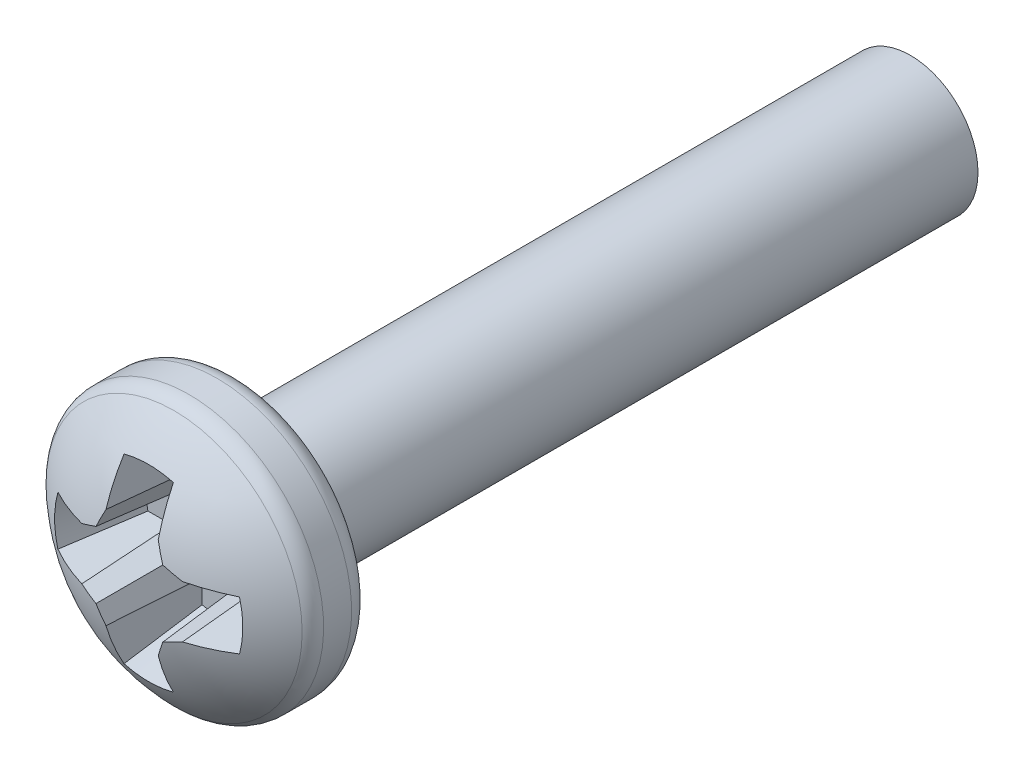
ISO-10303-21;
HEADER;
FILE_DESCRIPTION(('STEP AP214'),'2;1');
FILE_NAME('part.step','',(''),(''),'','','');
FILE_SCHEMA(('AUTOMOTIVE_DESIGN { 1 0 10303 214 1 1 1 1 }'));
ENDSEC;
DATA;
#1=APPLICATION_CONTEXT('core data for automotive mechanical design processes');
#2=APPLICATION_PROTOCOL_DEFINITION('international standard','automotive_design',2000,#1);
#3=PRODUCT_CONTEXT('',#1,'mechanical');
#4=PRODUCT('Part','Part','',(#3));
#5=PRODUCT_RELATED_PRODUCT_CATEGORY('part','',(#4));
#6=PRODUCT_DEFINITION_FORMATION('','',#4);
#7=PRODUCT_DEFINITION_CONTEXT('part definition',#1,'design');
#8=PRODUCT_DEFINITION('design','',#6,#7);
#9=PRODUCT_DEFINITION_SHAPE('','',#8);
#10=(LENGTH_UNIT() NAMED_UNIT(*) SI_UNIT(.MILLI.,.METRE.));
#11=(NAMED_UNIT(*) PLANE_ANGLE_UNIT() SI_UNIT($,.RADIAN.));
#12=(NAMED_UNIT(*) SI_UNIT($,.STERADIAN.) SOLID_ANGLE_UNIT());
#13=UNCERTAINTY_MEASURE_WITH_UNIT(LENGTH_MEASURE(1.E-05),#10,'distance_accuracy_value','');
#14=(GEOMETRIC_REPRESENTATION_CONTEXT(3) GLOBAL_UNCERTAINTY_ASSIGNED_CONTEXT((#13)) GLOBAL_UNIT_ASSIGNED_CONTEXT((#10,
#11,#12)) REPRESENTATION_CONTEXT('',''));
#15=CARTESIAN_POINT('',(0.,0.,0.));
#16=DIRECTION('',(0.,0.,1.));
#17=DIRECTION('',(1.,0.,0.));
#18=AXIS2_PLACEMENT_3D('',#15,#16,#17);
#19=CARTESIAN_POINT('',(0.251256313292348,0.606586399182261,11.7));
#20=DIRECTION('',(-0.381227206369648,-0.920363891963227,0.0871557427476583));
#21=DIRECTION('',(0.923879532511289,-0.382683432365084,0.));
#22=AXIS2_PLACEMENT_3D('',#19,#20,#21);
#23=PLANE('',#22);
#24=DIRECTION('',(0.923879532511289,-0.382683432365084,0.));
#25=VECTOR('',#24,1.);
#26=CARTESIAN_POINT('',(0.202877045628459,0.489788515050419,10.255));
#27=LINE('',#26,#25);
#28=CARTESIAN_POINT('',(0.405754091256926,0.405754091256924,10.255));
#29=VERTEX_POINT('',#28);
#30=CARTESIAN_POINT('',(0.72485327597371,0.273578881205037,10.255));
#31=VERTEX_POINT('',#30);
#32=EDGE_CURVE('E174',#29,#31,#27,.T.);
#33=ORIENTED_EDGE('',*,*,#32,.T.);
#34=DIRECTION('',(-0.01733375049386,-0.0871426484044397,-0.996045029063886));
#35=VECTOR('',#34,1.);
#36=CARTESIAN_POINT('',(0.747722237309717,0.388548913673446,11.5691134843641));
#37=LINE('',#36,#35);
#38=CARTESIAN_POINT('',(0.747722237309717,0.388548913673446,11.5691134843641));
#39=VERTEX_POINT('',#38);
#40=EDGE_CURVE('E177',#39,#31,#37,.T.);
#41=ORIENTED_EDGE('',*,*,#40,.F.);
#42=CARTESIAN_POINT('',(0.747722237309717,0.388548913673446,11.5691134843641));
#43=CARTESIAN_POINT('',(0.706240595369678,0.406589864651121,11.5781812676126));
#44=CARTESIAN_POINT('',(0.664562351791498,0.424604027894409,11.5861062190338));
#45=CARTESIAN_POINT('',(0.580812661358855,0.460578778912214,11.5996704582213));
#46=CARTESIAN_POINT('',(0.538741214504392,0.47853936668673,11.6053097459877));
#47=CARTESIAN_POINT('',(0.496473166011788,0.496473166726859,11.6098062019267));
#48=B_SPLINE_CURVE_WITH_KNOTS('',3,(#42,#43,#44,#45,#46,#47),.UNSPECIFIED.,.F.,.F.,(4,2,4),(0.,
0.138273346243273,0.276546692486546),.UNSPECIFIED.);
#49=CARTESIAN_POINT('',(0.496473166111229,0.496473166977632,11.609806201862));
#50=VERTEX_POINT('',#49);
#51=EDGE_CURVE('E160',#39,#50,#48,.T.);
#52=ORIENTED_EDGE('',*,*,#51,.T.);
#53=DIRECTION('',(0.0666626913468326,0.0666626913468325,0.995546167269401));
#54=VECTOR('',#53,1.);
#55=CARTESIAN_POINT('',(0.405754091256926,0.405754091256924,10.255));
#56=LINE('',#55,#54);
#57=EDGE_CURVE('E186',#29,#50,#56,.T.);
#58=ORIENTED_EDGE('',*,*,#57,.F.);
#59=EDGE_LOOP('',(#33,#41,#52,#58));
#60=FACE_BOUND('',#59,.T.);
#61=ADVANCED_FACE('F16',(#60),#23,.T.);
#62=CARTESIAN_POINT('',(0.251256313292361,-0.60658639918228,11.7));
#63=DIRECTION('',(-0.381227206369641,0.920363891963229,0.0871557427476603));
#64=DIRECTION('',(-0.923879532511292,-0.382683432365078,0.));
#65=AXIS2_PLACEMENT_3D('',#62,#63,#64);
#66=PLANE('',#65);
#67=DIRECTION('',(-0.923879532511292,-0.382683432365078,0.));
#68=VECTOR('',#67,1.);
#69=CARTESIAN_POINT('',(0.202877045628472,-0.489788515050435,10.255));
#70=LINE('',#69,#68);
#71=CARTESIAN_POINT('',(0.724853275973724,-0.273578881205057,10.255));
#72=VERTEX_POINT('',#71);
#73=CARTESIAN_POINT('',(0.405754091256938,-0.405754091256942,10.255));
#74=VERTEX_POINT('',#73);
#75=EDGE_CURVE('E356',#72,#74,#70,.T.);
#76=ORIENTED_EDGE('',*,*,#75,.T.);
#77=DIRECTION('',(-0.0666626913468337,0.0666626913468344,-0.995546167269401));
#78=VECTOR('',#77,1.);
#79=CARTESIAN_POINT('',(0.49647316651386,-0.496473166513865,11.6098062018733));
#80=LINE('',#79,#78);
#81=CARTESIAN_POINT('',(0.496473166867043,-0.496473166364015,11.6098062018357));
#82=VERTEX_POINT('',#81);
#83=EDGE_CURVE('E346',#82,#74,#80,.T.);
#84=ORIENTED_EDGE('',*,*,#83,.F.);
#85=CARTESIAN_POINT('',(0.496473167220227,-0.496473166214166,11.6098062017981));
#86=CARTESIAN_POINT('',(0.538741215508183,-0.47853936625876,11.6053097458587));
#87=CARTESIAN_POINT('',(0.580812662159621,-0.460578778569332,11.5996704581028));
#88=CARTESIAN_POINT('',(0.664562352189455,-0.424604027722433,11.5861062189582));
#89=CARTESIAN_POINT('',(0.706240595567853,-0.406589864564961,11.5781812675693));
#90=CARTESIAN_POINT('',(0.747722237309732,-0.388548913673467,11.5691134843641));
#91=B_SPLINE_CURVE_WITH_KNOTS('',3,(#85,#86,#87,#88,#89,#90),.UNSPECIFIED.,.F.,.F.,(4,2,4),(0.,
0.138273345583997,0.276546691167995),.UNSPECIFIED.);
#92=CARTESIAN_POINT('',(0.747722237309732,-0.388548913673467,11.5691134843641));
#93=VERTEX_POINT('',#92);
#94=EDGE_CURVE('E358',#82,#93,#91,.T.);
#95=ORIENTED_EDGE('',*,*,#94,.T.);
#96=DIRECTION('',(0.0173337504938609,-0.0871426484044412,0.996045029063886));
#97=VECTOR('',#96,1.);
#98=CARTESIAN_POINT('',(0.724853275973724,-0.273578881205057,10.255));
#99=LINE('',#98,#97);
#100=EDGE_CURVE('E313',#72,#93,#99,.T.);
#101=ORIENTED_EDGE('',*,*,#100,.F.);
#102=EDGE_LOOP('',(#76,#84,#95,#101));
#103=FACE_BOUND('',#102,.T.);
#104=ADVANCED_FACE('F529',(#103),#66,.T.);
#105=CARTESIAN_POINT('',(0.606586399182278,-0.251256313292368,11.7));
#106=DIRECTION('',(-0.920363891963225,0.381227206369651,0.0871557427476602));
#107=DIRECTION('',(-0.382683432365087,-0.923879532511288,0.));
#108=AXIS2_PLACEMENT_3D('',#105,#106,#107);
#109=PLANE('',#108);
#110=DIRECTION('',(-0.382683432365087,-0.923879532511288,0.));
#111=VECTOR('',#110,1.);
#112=CARTESIAN_POINT('',(0.489788515050433,-0.202877045628477,10.255));
#113=LINE('',#112,#111);
#114=CARTESIAN_POINT('',(0.273578881205049,-0.724853275973728,10.255));
#115=VERTEX_POINT('',#114);
#116=EDGE_CURVE('E349',#74,#115,#113,.T.);
#117=ORIENTED_EDGE('',*,*,#116,.T.);
#118=DIRECTION('',(-0.0871426484044411,0.0173337504938618,-0.996045029063885));
#119=VECTOR('',#118,1.);
#120=CARTESIAN_POINT('',(0.38854891367346,-0.747722237309736,11.5691134843641));
#121=LINE('',#120,#119);
#122=CARTESIAN_POINT('',(0.38854891367346,-0.747722237309736,11.5691134843641));
#123=VERTEX_POINT('',#122);
#124=EDGE_CURVE('E307',#123,#115,#121,.T.);
#125=ORIENTED_EDGE('',*,*,#124,.F.);
#126=CARTESIAN_POINT('',(0.38854891367346,-0.747722237309736,11.5691134843641));
#127=CARTESIAN_POINT('',(0.406589864650785,-0.706240595370502,11.5781812676125));
#128=CARTESIAN_POINT('',(0.424604027893725,-0.664562351793134,11.5861062190335));
#129=CARTESIAN_POINT('',(0.460578778910836,-0.580812661362128,11.5996704582209));
#130=CARTESIAN_POINT('',(0.478539366685007,-0.53874121450849,11.6053097459872));
#131=CARTESIAN_POINT('',(0.496473166724792,-0.496473166016717,11.6098062019261));
#132=B_SPLINE_CURVE_WITH_KNOTS('',3,(#126,#127,#128,#129,#130,#131),.UNSPECIFIED.,.F.,.F.,(4,2,
4),(0.,0.138273346240595,0.27654669248119),.UNSPECIFIED.);
#133=EDGE_CURVE('E350',#123,#82,#132,.T.);
#134=ORIENTED_EDGE('',*,*,#133,.T.);
#135=ORIENTED_EDGE('',*,*,#83,.T.);
#136=EDGE_LOOP('',(#117,#125,#134,#135));
#137=FACE_BOUND('',#136,.T.);
#138=ADVANCED_FACE('F546',(#137),#109,.T.);
#139=CARTESIAN_POINT('',(-0.606586399182264,-0.251256313292377,11.7));
#140=DIRECTION('',(0.920363891963231,0.381227206369638,0.0871557427476595));
#141=DIRECTION('',(-0.382683432365074,0.923879532511293,0.));
#142=AXIS2_PLACEMENT_3D('',#139,#140,#141);
#143=PLANE('',#142);
#144=DIRECTION('',(-0.382683432365074,0.923879532511293,0.));
#145=VECTOR('',#144,1.);
#146=CARTESIAN_POINT('',(-0.489788515050419,-0.202877045628488,10.255));
#147=LINE('',#146,#145);
#148=CARTESIAN_POINT('',(-0.273578881205045,-0.724853275973738,10.255));
#149=VERTEX_POINT('',#148);
#150=CARTESIAN_POINT('',(-0.405754091256928,-0.405754091256952,10.255));
#151=VERTEX_POINT('',#150);
#152=EDGE_CURVE('E341',#149,#151,#147,.T.);
#153=ORIENTED_EDGE('',*,*,#152,.T.);
#154=DIRECTION('',(0.0666626913468331,0.066662691346835,-0.995546167269401));
#155=VECTOR('',#154,1.);
#156=CARTESIAN_POINT('',(-0.496473166513849,-0.496473166513876,11.6098062018733));
#157=LINE('',#156,#155);
#158=CARTESIAN_POINT('',(-0.496473166362261,-0.496473166871155,11.6098062018353));
#159=VERTEX_POINT('',#158);
#160=EDGE_CURVE('E331',#159,#151,#157,.T.);
#161=ORIENTED_EDGE('',*,*,#160,.F.);
#162=CARTESIAN_POINT('',(-0.496473166210673,-0.496473167228434,11.6098062017973));
#163=CARTESIAN_POINT('',(-0.478539366255842,-0.538741215515003,11.6053097458578));
#164=CARTESIAN_POINT('',(-0.460578778566992,-0.580812662165064,11.599670458102));
#165=CARTESIAN_POINT('',(-0.424604027721252,-0.664562352192168,11.5861062189576));
#166=CARTESIAN_POINT('',(-0.406589864564363,-0.706240595569212,11.5781812675691));
#167=CARTESIAN_POINT('',(-0.388548913673453,-0.747722237309747,11.5691134843641));
#168=B_SPLINE_CURVE_WITH_KNOTS('',3,(#162,#163,#164,#165,#166,#167),.UNSPECIFIED.,.F.,.F.,(4,2,
4),(0.,0.138273345579527,0.276546691159055),.UNSPECIFIED.);
#169=CARTESIAN_POINT('',(-0.388548913673453,-0.747722237309747,11.5691134843641));
#170=VERTEX_POINT('',#169);
#171=EDGE_CURVE('E343',#159,#170,#168,.T.);
#172=ORIENTED_EDGE('',*,*,#171,.T.);
#173=DIRECTION('',(-0.0871426484044398,-0.0173337504938622,0.996045029063886));
#174=VECTOR('',#173,1.);
#175=CARTESIAN_POINT('',(-0.273578881205044,-0.724853275973738,10.255));
#176=LINE('',#175,#174);
#177=EDGE_CURVE('E301',#149,#170,#176,.T.);
#178=ORIENTED_EDGE('',*,*,#177,.F.);
#179=EDGE_LOOP('',(#153,#161,#172,#178));
#180=FACE_BOUND('',#179,.T.);
#181=ADVANCED_FACE('F550',(#180),#143,.T.);
#182=CARTESIAN_POINT('',(-0.251256313292352,-0.606586399182294,11.7));
#183=DIRECTION('',(0.381227206369654,0.920363891963224,0.0871557427476611));
#184=DIRECTION('',(-0.923879532511287,0.38268343236509,0.));
#185=AXIS2_PLACEMENT_3D('',#182,#183,#184);
#186=PLANE('',#185);
#187=DIRECTION('',(-0.923879532511287,0.38268343236509,0.));
#188=VECTOR('',#187,1.);
#189=CARTESIAN_POINT('',(-0.202877045628461,-0.489788515050449,10.255));
#190=LINE('',#189,#188);
#191=CARTESIAN_POINT('',(-0.724853275973714,-0.273578881205062,10.255));
#192=VERTEX_POINT('',#191);
#193=EDGE_CURVE('E334',#151,#192,#190,.T.);
#194=ORIENTED_EDGE('',*,*,#193,.T.);
#195=DIRECTION('',(0.0173337504938607,0.0871426484044425,-0.996045029063885));
#196=VECTOR('',#195,1.);
#197=CARTESIAN_POINT('',(-0.74772223730972,-0.388548913673474,11.5691134843641));
#198=LINE('',#197,#196);
#199=CARTESIAN_POINT('',(-0.74772223730972,-0.388548913673475,11.5691134843641));
#200=VERTEX_POINT('',#199);
#201=EDGE_CURVE('E289',#200,#192,#198,.T.);
#202=ORIENTED_EDGE('',*,*,#201,.F.);
#203=CARTESIAN_POINT('',(-0.747722237309721,-0.388548913673475,11.5691134843641));
#204=CARTESIAN_POINT('',(-0.706240595369682,-0.40658986465115,11.5781812676126));
#205=CARTESIAN_POINT('',(-0.664562351791502,-0.424604027894439,11.5861062190338));
#206=CARTESIAN_POINT('',(-0.580812661358859,-0.460578778912244,11.5996704582213));
#207=CARTESIAN_POINT('',(-0.538741214504396,-0.47853936668676,11.6053097459877));
#208=CARTESIAN_POINT('',(-0.496473166011792,-0.49647316672689,11.6098062019266));
#209=B_SPLINE_CURVE_WITH_KNOTS('',3,(#203,#204,#205,#206,#207,#208),.UNSPECIFIED.,.F.,.F.,(4,2,
4),(0.,0.138273346243273,0.276546692486546),.UNSPECIFIED.);
#210=EDGE_CURVE('E335',#200,#159,#209,.T.);
#211=ORIENTED_EDGE('',*,*,#210,.T.);
#212=ORIENTED_EDGE('',*,*,#160,.T.);
#213=EDGE_LOOP('',(#194,#202,#211,#212));
#214=FACE_BOUND('',#213,.T.);
#215=ADVANCED_FACE('F555',(#214),#186,.T.);
#216=CARTESIAN_POINT('',(-0.251256313292357,0.606586399182247,11.7));
#217=DIRECTION('',(0.381227206369635,-0.920363891963232,0.0871557427476575));
#218=DIRECTION('',(0.923879532511295,0.382683432365071,0.));
#219=AXIS2_PLACEMENT_3D('',#216,#217,#218);
#220=PLANE('',#219);
#221=DIRECTION('',(0.923879532511295,0.382683432365071,0.));
#222=VECTOR('',#221,1.);
#223=CARTESIAN_POINT('',(-0.20287704562847,0.489788515050405,10.255));
#224=LINE('',#223,#222);
#225=CARTESIAN_POINT('',(-0.724853275973722,0.273578881205032,10.255));
#226=VERTEX_POINT('',#225);
#227=CARTESIAN_POINT('',(-0.405754091256936,0.405754091256914,10.255));
#228=VERTEX_POINT('',#227);
#229=EDGE_CURVE('E326',#226,#228,#224,.T.);
#230=ORIENTED_EDGE('',*,*,#229,.T.);
#231=DIRECTION('',(0.0666626913468333,-0.0666626913468319,-0.995546167269401));
#232=VECTOR('',#231,1.);
#233=CARTESIAN_POINT('',(-0.496473166513857,0.496473166513834,11.6098062018733));
#234=LINE('',#233,#232);
#235=CARTESIAN_POINT('',(-0.49647316686704,0.496473166363984,11.6098062018357));
#236=VERTEX_POINT('',#235);
#237=EDGE_CURVE('E283',#236,#228,#234,.T.);
#238=ORIENTED_EDGE('',*,*,#237,.F.);
#239=CARTESIAN_POINT('',(-0.496473167220223,0.496473166214134,11.6098062017981));
#240=CARTESIAN_POINT('',(-0.538741215508179,0.478539366258729,11.6053097458587));
#241=CARTESIAN_POINT('',(-0.580812662159616,0.460578778569302,11.5996704581028));
#242=CARTESIAN_POINT('',(-0.664562352189452,0.424604027722403,11.5861062189582));
#243=CARTESIAN_POINT('',(-0.70624059556785,0.406589864564932,11.5781812675693));
#244=CARTESIAN_POINT('',(-0.747722237309729,0.388548913673438,11.5691134843641));
#245=B_SPLINE_CURVE_WITH_KNOTS('',3,(#239,#240,#241,#242,#243,#244),.UNSPECIFIED.,.F.,.F.,(4,2,
4),(0.,0.138273345583997,0.276546691167995),.UNSPECIFIED.);
#246=CARTESIAN_POINT('',(-0.747722237309729,0.388548913673438,11.5691134843641));
#247=VERTEX_POINT('',#246);
#248=EDGE_CURVE('E328',#236,#247,#245,.T.);
#249=ORIENTED_EDGE('',*,*,#248,.T.);
#250=DIRECTION('',(-0.0173337504938603,0.0871426484044384,0.996045029063886));
#251=VECTOR('',#250,1.);
#252=CARTESIAN_POINT('',(-0.724853275973722,0.273578881205032,10.255));
#253=LINE('',#252,#251);
#254=EDGE_CURVE('E295',#226,#247,#253,.T.);
#255=ORIENTED_EDGE('',*,*,#254,.F.);
#256=EDGE_LOOP('',(#230,#238,#249,#255));
#257=FACE_BOUND('',#256,.T.);
#258=ADVANCED_FACE('F571',(#257),#220,.T.);
#259=CARTESIAN_POINT('',(0.606586399182262,0.251256313292346,11.7));
#260=DIRECTION('',(-0.920363891963228,-0.381227206369645,0.0871557427476583));
#261=DIRECTION('',(0.382683432365081,-0.92387953251129,0.));
#262=AXIS2_PLACEMENT_3D('',#259,#260,#261);
#263=PLANE('',#262);
#264=DIRECTION('',(0.382683432365081,-0.92387953251129,0.));
#265=VECTOR('',#264,1.);
#266=CARTESIAN_POINT('',(0.48978851505042,0.202877045628457,10.255));
#267=LINE('',#266,#265);
#268=CARTESIAN_POINT('',(0.273578881205039,0.72485327597371,10.255));
#269=VERTEX_POINT('',#268);
#270=EDGE_CURVE('E188',#269,#29,#267,.T.);
#271=ORIENTED_EDGE('',*,*,#270,.T.);
#272=ORIENTED_EDGE('',*,*,#57,.T.);
#273=CARTESIAN_POINT('',(0.496473166210671,0.496473167228403,11.6098062017973));
#274=CARTESIAN_POINT('',(0.47853936625584,0.538741215514973,11.6053097458579));
#275=CARTESIAN_POINT('',(0.460578778566989,0.580812662165033,11.599670458102));
#276=CARTESIAN_POINT('',(0.424604027721247,0.664562352192138,11.5861062189576));
#277=CARTESIAN_POINT('',(0.406589864564357,0.706240595569182,11.5781812675691));
#278=CARTESIAN_POINT('',(0.388548913673447,0.747722237309717,11.5691134843641));
#279=B_SPLINE_CURVE_WITH_KNOTS('',3,(#273,#274,#275,#276,#277,#278),.UNSPECIFIED.,.F.,.F.,(4,2,
4),(0.,0.138273345579529,0.276546691159058),.UNSPECIFIED.);
#280=CARTESIAN_POINT('',(0.388548913673448,0.747722237309717,11.5691134843641));
#281=VERTEX_POINT('',#280);
#282=EDGE_CURVE('E170',#50,#281,#279,.T.);
#283=ORIENTED_EDGE('',*,*,#282,.T.);
#284=DIRECTION('',(0.0871426484044397,0.0173337504938599,0.996045029063886));
#285=VECTOR('',#284,1.);
#286=CARTESIAN_POINT('',(0.273578881205039,0.72485327597371,10.255));
#287=LINE('',#286,#285);
#288=EDGE_CURVE('E271',#269,#281,#287,.T.);
#289=ORIENTED_EDGE('',*,*,#288,.F.);
#290=EDGE_LOOP('',(#271,#272,#283,#289));
#291=FACE_BOUND('',#290,.T.);
#292=ADVANCED_FACE('F574',(#291),#263,.T.);
#293=CARTESIAN_POINT('',(0.,0.399999999999998,11.7));
#294=DIRECTION('',(0.,-0.996194698091746,0.0871557427476584));
#295=DIRECTION('',(0.,-0.0871557427476584,-0.996194698091746));
#296=AXIS2_PLACEMENT_3D('',#293,#294,#295);
#297=PLANE('',#296);
#298=DIRECTION('',(1.,0.,0.));
#299=VECTOR('',#298,1.);
#300=CARTESIAN_POINT('',(0.,0.273578881205037,10.255));
#301=LINE('',#300,#299);
#302=CARTESIAN_POINT('',(1.07866041768907,0.273578881205037,10.2549999999862));
#303=VERTEX_POINT('',#302);
#304=EDGE_CURVE('E262',#303,#31,#301,.F.);
#305=ORIENTED_EDGE('',*,*,#304,.F.);
#306=CARTESIAN_POINT('',(1.07866041768837,0.273578881203481,10.2549999999822));
#307=CARTESIAN_POINT('',(1.12387399307669,0.289138832841713,10.4328510610357));
#308=CARTESIAN_POINT('',(1.16907297531068,0.304699106366915,10.610705801274));
#309=CARTESIAN_POINT('',(1.25944175340125,0.335820297167585,10.9664226398499));
#310=CARTESIAN_POINT('',(1.30461154925788,0.351381214443052,11.1442847381874));
#311=CARTESIAN_POINT('',(1.34976675196023,0.366942453605488,11.3221505157098));
#312=B_SPLINE_CURVE_WITH_KNOTS('',3,(#306,#307,#308,#309,#310,#311),.UNSPECIFIED.,.F.,.F.,(4,2,
4),(0.,0.552500143521879,1.10500028620324),.UNSPECIFIED.);
#313=CARTESIAN_POINT('',(1.34976675196804,0.366942453606028,11.322150515716));
#314=VERTEX_POINT('',#313);
#315=EDGE_CURVE('E185',#303,#314,#312,.T.);
#316=ORIENTED_EDGE('',*,*,#315,.T.);
#317=CARTESIAN_POINT('',(1.34976675197584,0.366942453606568,11.3221505157221));
#318=CARTESIAN_POINT('',(1.25429248537478,0.371573566431086,11.3750843775264));
#319=CARTESIAN_POINT('',(1.15638497585207,0.375689661182252,11.4221315558153));
#320=CARTESIAN_POINT('',(0.955703470963361,0.382891814537878,11.5044525453626));
#321=CARTESIAN_POINT('',(0.852929475597362,0.385977873142338,11.539726356621));
#322=CARTESIAN_POINT('',(0.747722237309717,0.388548913673446,11.5691134843641));
#323=B_SPLINE_CURVE_WITH_KNOTS('',3,(#317,#318,#319,#320,#321,#322),.UNSPECIFIED.,.F.,.F.,(4,2,
4),(0.,0.326107860648935,0.65221572129787),.UNSPECIFIED.);
#324=EDGE_CURVE('E167',#314,#39,#323,.T.);
#325=ORIENTED_EDGE('',*,*,#324,.T.);
#326=ORIENTED_EDGE('',*,*,#40,.T.);
#327=EDGE_LOOP('',(#305,#316,#325,#326));
#328=FACE_BOUND('',#327,.T.);
#329=ADVANCED_FACE('F183',(#328),#297,.T.);
#330=CARTESIAN_POINT('',(0.,-0.400000000000017,11.7));
#331=DIRECTION('',(0.,0.996194698091745,0.0871557427476598));
#332=DIRECTION('',(0.,-0.0871557427476598,0.996194698091745));
#333=AXIS2_PLACEMENT_3D('',#330,#331,#332);
#334=PLANE('',#333);
#335=DIRECTION('',(1.,0.,0.));
#336=VECTOR('',#335,1.);
#337=CARTESIAN_POINT('',(0.,-0.273578881205057,10.255));
#338=LINE('',#337,#336);
#339=CARTESIAN_POINT('',(1.07866041768681,-0.27357888120428,10.2549999999773));
#340=VERTEX_POINT('',#339);
#341=EDGE_CURVE('E266',#72,#340,#338,.T.);
#342=ORIENTED_EDGE('',*,*,#341,.F.);
#343=ORIENTED_EDGE('',*,*,#100,.T.);
#344=CARTESIAN_POINT('',(0.747722237309732,-0.388548913673467,11.5691134843641));
#345=CARTESIAN_POINT('',(0.852929475597373,-0.38597787314236,11.539726356621));
#346=CARTESIAN_POINT('',(0.95570347096337,-0.3828918145379,11.5044525453626));
#347=CARTESIAN_POINT('',(1.15638497585207,-0.375689661182275,11.4221315558153));
#348=CARTESIAN_POINT('',(1.25429248537478,-0.37157356643111,11.3750843775264));
#349=CARTESIAN_POINT('',(1.34976675197584,-0.366942453606592,11.3221505157221));
#350=B_SPLINE_CURVE_WITH_KNOTS('',3,(#344,#345,#346,#347,#348,#349),.UNSPECIFIED.,.F.,.F.,(4,2,
4),(0.,0.326107860648925,0.65221572129785),.UNSPECIFIED.);
#351=CARTESIAN_POINT('',(1.34976675196803,-0.366942453606052,11.322150515716));
#352=VERTEX_POINT('',#351);
#353=EDGE_CURVE('E181',#93,#352,#350,.T.);
#354=ORIENTED_EDGE('',*,*,#353,.T.);
#355=CARTESIAN_POINT('',(1.34976675196022,-0.366942453605512,11.3221505157098));
#356=CARTESIAN_POINT('',(1.30461154925788,-0.351381214443076,11.1442847381874));
#357=CARTESIAN_POINT('',(1.25944175340125,-0.335820297167608,10.9664226398499));
#358=CARTESIAN_POINT('',(1.16907297531067,-0.304699106366937,10.610705801274));
#359=CARTESIAN_POINT('',(1.12387399307669,-0.289138832841735,10.4328510610357));
#360=CARTESIAN_POINT('',(1.07866041768837,-0.273578881203502,10.2549999999822));
#361=B_SPLINE_CURVE_WITH_KNOTS('',3,(#355,#356,#357,#358,#359,#360),.UNSPECIFIED.,.F.,.F.,(4,2,
4),(0.,0.552500142681358,1.10500028620324),.UNSPECIFIED.);
#362=EDGE_CURVE('E487',#352,#340,#361,.T.);
#363=ORIENTED_EDGE('',*,*,#362,.T.);
#364=EDGE_LOOP('',(#342,#343,#354,#363));
#365=FACE_BOUND('',#364,.T.);
#366=ADVANCED_FACE('F492',(#365),#334,.T.);
#367=CARTESIAN_POINT('',(0.400000000000015,0.,11.7));
#368=DIRECTION('',(-0.996194698091745,0.,0.0871557427476598));
#369=DIRECTION('',(0.0871557427476598,0.,0.996194698091745));
#370=AXIS2_PLACEMENT_3D('',#367,#368,#369);
#371=PLANE('',#370);
#372=DIRECTION('',(0.,1.,0.));
#373=VECTOR('',#372,1.);
#374=CARTESIAN_POINT('',(0.273578881205049,0.,10.255));
#375=LINE('',#374,#373);
#376=CARTESIAN_POINT('',(0.273578881205049,-1.07866041767911,10.2550000000146));
#377=VERTEX_POINT('',#376);
#378=EDGE_CURVE('E238',#377,#115,#375,.T.);
#379=ORIENTED_EDGE('',*,*,#378,.F.);
#380=CARTESIAN_POINT('',(0.273578881206636,-1.07866041767969,10.2550000000181));
#381=CARTESIAN_POINT('',(0.28913883284434,-1.12387399307169,10.4328510610655));
#382=CARTESIAN_POINT('',(0.304699106369014,-1.16907297530938,10.6107058012978));
#383=CARTESIAN_POINT('',(0.335820297168627,-1.25944175340738,10.9664226398616));
#384=CARTESIAN_POINT('',(0.351381214443566,-1.30461154926774,11.1442847381931));
#385=CARTESIAN_POINT('',(0.366942453605472,-1.34976675197382,11.3221505157095));
#386=B_SPLINE_CURVE_WITH_KNOTS('',3,(#380,#381,#382,#383,#384,#385),.UNSPECIFIED.,.F.,.F.,(4,2,
4),(0.,0.552500143506974,1.10500028617343),.UNSPECIFIED.);
#387=CARTESIAN_POINT('',(0.366942453605868,-1.34976675197808,11.322150515714));
#388=VERTEX_POINT('',#387);
#389=EDGE_CURVE('E472',#377,#388,#386,.T.);
#390=ORIENTED_EDGE('',*,*,#389,.T.);
#391=CARTESIAN_POINT('',(0.366942453606264,-1.34976675198234,11.3221505157185));
#392=CARTESIAN_POINT('',(0.371573566430858,-1.25429248538033,11.3750843775236));
#393=CARTESIAN_POINT('',(0.375689661182088,-1.1563849758566,11.4221315558133));
#394=CARTESIAN_POINT('',(0.38289181453782,-0.95570347096573,11.5044525453618));
#395=CARTESIAN_POINT('',(0.385977873142322,-0.852929475598587,11.5397263566207));
#396=CARTESIAN_POINT('',(0.38854891367346,-0.747722237309736,11.5691134843641));
#397=B_SPLINE_CURVE_WITH_KNOTS('',3,(#391,#392,#393,#394,#395,#396),.UNSPECIFIED.,.F.,.F.,(4,2,
4),(0.,0.326107860652638,0.652215721305277),.UNSPECIFIED.);
#398=EDGE_CURVE('E310',#388,#123,#397,.T.);
#399=ORIENTED_EDGE('',*,*,#398,.T.);
#400=ORIENTED_EDGE('',*,*,#124,.T.);
#401=EDGE_LOOP('',(#379,#390,#399,#400));
#402=FACE_BOUND('',#401,.T.);
#403=ADVANCED_FACE('F495',(#402),#371,.T.);
#404=CARTESIAN_POINT('',(-0.4,0.,11.7));
#405=DIRECTION('',(0.996194698091746,0.,0.0871557427476584));
#406=DIRECTION('',(0.0871557427476584,0.,-0.996194698091746));
#407=AXIS2_PLACEMENT_3D('',#404,#405,#406);
#408=PLANE('',#407);
#409=DIRECTION('',(0.,1.,0.));
#410=VECTOR('',#409,1.);
#411=CARTESIAN_POINT('',(-0.273578881205045,0.,10.255));
#412=LINE('',#411,#410);
#413=CARTESIAN_POINT('',(-0.27357888120584,-1.07866041768141,10.2550000000237));
#414=VERTEX_POINT('',#413);
#415=EDGE_CURVE('E241',#149,#414,#412,.F.);
#416=ORIENTED_EDGE('',*,*,#415,.F.);
#417=ORIENTED_EDGE('',*,*,#177,.T.);
#418=CARTESIAN_POINT('',(-0.388548913673453,-0.747722237309748,11.5691134843641));
#419=CARTESIAN_POINT('',(-0.385977873142317,-0.852929475598596,11.5397263566207));
#420=CARTESIAN_POINT('',(-0.382891814537816,-0.955703470965737,11.5044525453618));
#421=CARTESIAN_POINT('',(-0.375689661182086,-1.1563849758566,11.4221315558133));
#422=CARTESIAN_POINT('',(-0.371573566430857,-1.25429248538033,11.3750843775236));
#423=CARTESIAN_POINT('',(-0.366942453606264,-1.34976675198234,11.3221505157185));
#424=B_SPLINE_CURVE_WITH_KNOTS('',3,(#418,#419,#420,#421,#422,#423),.UNSPECIFIED.,.F.,.F.,(4,2,
4),(0.,0.326107860652632,0.652215721305263),.UNSPECIFIED.);
#425=CARTESIAN_POINT('',(-0.366942453605868,-1.34976675197808,11.322150515714));
#426=VERTEX_POINT('',#425);
#427=EDGE_CURVE('E304',#170,#426,#424,.T.);
#428=ORIENTED_EDGE('',*,*,#427,.T.);
#429=CARTESIAN_POINT('',(-0.366942453605472,-1.34976675197381,11.3221505157095));
#430=CARTESIAN_POINT('',(-0.351381214443565,-1.30461154926773,11.1442847381931));
#431=CARTESIAN_POINT('',(-0.335820297168626,-1.25944175340737,10.9664226398616));
#432=CARTESIAN_POINT('',(-0.304699106369013,-1.16907297530937,10.6107058012978));
#433=CARTESIAN_POINT('',(-0.289138832844339,-1.12387399307169,10.4328510610655));
#434=CARTESIAN_POINT('',(-0.273578881206634,-1.07866041767968,10.2550000000181));
#435=B_SPLINE_CURVE_WITH_KNOTS('',3,(#429,#430,#431,#432,#433,#434),.UNSPECIFIED.,.F.,.F.,(4,2,
4),(0.,0.552500142666454,1.10500028617343),.UNSPECIFIED.);
#436=EDGE_CURVE('E467',#426,#414,#435,.T.);
#437=ORIENTED_EDGE('',*,*,#436,.T.);
#438=EDGE_LOOP('',(#416,#417,#428,#437));
#439=FACE_BOUND('',#438,.T.);
#440=ADVANCED_FACE('F453',(#439),#408,.T.);
#441=CARTESIAN_POINT('',(0.,0.399999999999983,11.7));
#442=DIRECTION('',(0.,-0.996194698091746,0.0871557427476569));
#443=DIRECTION('',(0.,-0.0871557427476569,-0.996194698091746));
#444=AXIS2_PLACEMENT_3D('',#441,#442,#443);
#445=PLANE('',#444);
#446=DIRECTION('',(1.,0.,0.));
#447=VECTOR('',#446,1.);
#448=CARTESIAN_POINT('',(0.,0.273578881205032,10.255));
#449=LINE('',#448,#447);
#450=CARTESIAN_POINT('',(-1.0786604176868,0.273578881204255,10.2549999999773));
#451=VERTEX_POINT('',#450);
#452=EDGE_CURVE('E251',#226,#451,#449,.F.);
#453=ORIENTED_EDGE('',*,*,#452,.F.);
#454=ORIENTED_EDGE('',*,*,#254,.T.);
#455=CARTESIAN_POINT('',(-0.747722237309729,0.388548913673438,11.5691134843641));
#456=CARTESIAN_POINT('',(-0.852929475599294,0.385977873142284,11.5397263566205));
#457=CARTESIAN_POINT('',(-0.955703470967113,0.38289181453776,11.5044525453613));
#458=CARTESIAN_POINT('',(-1.15638497585926,0.375689661181969,11.4221315558121));
#459=CARTESIAN_POINT('',(-1.25429248538359,0.371573566430703,11.375084377522));
#460=CARTESIAN_POINT('',(-1.34976675198617,0.366942453606067,11.3221505157164));
#461=B_SPLINE_CURVE_WITH_KNOTS('',3,(#455,#456,#457,#458,#459,#460),.UNSPECIFIED.,.F.,.F.,(4,2,
4),(0.,0.326107860654829,0.652215721309657),.UNSPECIFIED.);
#462=CARTESIAN_POINT('',(-1.34976675198749,0.366942453605627,11.3221505157114));
#463=VERTEX_POINT('',#462);
#464=EDGE_CURVE('E298',#247,#463,#461,.T.);
#465=ORIENTED_EDGE('',*,*,#464,.T.);
#466=CARTESIAN_POINT('',(-1.3497667519888,0.366942453605188,11.3221505157064));
#467=CARTESIAN_POINT('',(-1.30461154928167,0.351381214442802,11.1442847381845));
#468=CARTESIAN_POINT('',(-1.25944175342027,0.335820297167385,10.9664226398476));
#469=CARTESIAN_POINT('',(-1.16907297532016,0.304699106366815,10.6107058012728));
#470=CARTESIAN_POINT('',(-1.12387399308142,0.289138832841662,10.4328510610351));
#471=CARTESIAN_POINT('',(-1.07866041768836,0.273578881203479,10.2549999999822));
#472=B_SPLINE_CURVE_WITH_KNOTS('',3,(#466,#467,#468,#469,#470,#471),.UNSPECIFIED.,.F.,.F.,(4,2,
4),(0.,0.5525001426832,1.10500028620692),.UNSPECIFIED.);
#473=EDGE_CURVE('E459',#463,#451,#472,.T.);
#474=ORIENTED_EDGE('',*,*,#473,.T.);
#475=EDGE_LOOP('',(#453,#454,#465,#474));
#476=FACE_BOUND('',#475,.T.);
#477=ADVANCED_FACE('F447',(#476),#445,.T.);
#478=CARTESIAN_POINT('',(0.,-0.400000000000032,11.7));
#479=DIRECTION('',(0.,0.996194698091745,0.0871557427476613));
#480=DIRECTION('',(0.,-0.0871557427476613,0.996194698091745));
#481=AXIS2_PLACEMENT_3D('',#478,#479,#480);
#482=PLANE('',#481);
#483=DIRECTION('',(1.,0.,0.));
#484=VECTOR('',#483,1.);
#485=CARTESIAN_POINT('',(0.,-0.27357888120506,10.255));
#486=LINE('',#485,#484);
#487=CARTESIAN_POINT('',(-1.07866041768907,-0.27357888120506,10.2549999999862));
#488=VERTEX_POINT('',#487);
#489=EDGE_CURVE('E246',#488,#192,#486,.T.);
#490=ORIENTED_EDGE('',*,*,#489,.F.);
#491=CARTESIAN_POINT('',(-1.07866041768837,-0.273578881203504,10.2549999999822));
#492=CARTESIAN_POINT('',(-1.12387399308143,-0.289138832841687,10.4328510610351));
#493=CARTESIAN_POINT('',(-1.16907297532018,-0.304699106366839,10.6107058012728));
#494=CARTESIAN_POINT('',(-1.25944175342028,-0.33582029716741,10.9664226398476));
#495=CARTESIAN_POINT('',(-1.30461154928168,-0.351381214442827,11.1442847381845));
#496=CARTESIAN_POINT('',(-1.34976675198881,-0.366942453605212,11.3221505157064));
#497=B_SPLINE_CURVE_WITH_KNOTS('',3,(#491,#492,#493,#494,#495,#496),.UNSPECIFIED.,.F.,.F.,(4,2,
4),(0.,0.552500143523723,1.10500028620692),.UNSPECIFIED.);
#498=CARTESIAN_POINT('',(-1.34976675198749,-0.366942453605651,11.3221505157114));
#499=VERTEX_POINT('',#498);
#500=EDGE_CURVE('E230',#488,#499,#497,.T.);
#501=ORIENTED_EDGE('',*,*,#500,.T.);
#502=CARTESIAN_POINT('',(-1.34976675198617,-0.366942453606091,11.3221505157164));
#503=CARTESIAN_POINT('',(-1.25429248538359,-0.37157356643073,11.375084377522));
#504=CARTESIAN_POINT('',(-1.15638497585926,-0.375689661181998,11.4221315558121));
#505=CARTESIAN_POINT('',(-0.955703470967109,-0.382891814537792,11.5044525453613));
#506=CARTESIAN_POINT('',(-0.852929475599287,-0.385977873142319,11.5397263566205));
#507=CARTESIAN_POINT('',(-0.747722237309721,-0.388548913673475,11.5691134843641));
#508=B_SPLINE_CURVE_WITH_KNOTS('',3,(#502,#503,#504,#505,#506,#507),.UNSPECIFIED.,.F.,.F.,(4,2,
4),(0.,0.326107860654835,0.65221572130967),.UNSPECIFIED.);
#509=EDGE_CURVE('E292',#499,#200,#508,.T.);
#510=ORIENTED_EDGE('',*,*,#509,.T.);
#511=ORIENTED_EDGE('',*,*,#201,.T.);
#512=EDGE_LOOP('',(#490,#501,#510,#511));
#513=FACE_BOUND('',#512,.T.);
#514=ADVANCED_FACE('F444',(#513),#482,.T.);
#515=CARTESIAN_POINT('',(-0.606586399182276,0.251256313292337,11.7));
#516=DIRECTION('',(0.920363891963223,-0.381227206369657,0.0871557427476592));
#517=DIRECTION('',(0.382683432365094,0.923879532511285,0.));
#518=AXIS2_PLACEMENT_3D('',#515,#516,#517);
#519=PLANE('',#518);
#520=DIRECTION('',(-0.382683432365094,-0.923879532511285,0.));
#521=VECTOR('',#520,1.);
#522=CARTESIAN_POINT('',(-0.273578881205045,0.724853275973699,10.255));
#523=LINE('',#522,#521);
#524=CARTESIAN_POINT('',(-0.273578881205045,0.724853275973699,10.255));
#525=VERTEX_POINT('',#524);
#526=EDGE_CURVE('E256',#525,#228,#523,.T.);
#527=ORIENTED_EDGE('',*,*,#526,.F.);
#528=DIRECTION('',(0.087142648404441,-0.0173337504938594,-0.996045029063885));
#529=VECTOR('',#528,1.);
#530=CARTESIAN_POINT('',(-0.388548913673455,0.747722237309705,11.5691134843641));
#531=LINE('',#530,#529);
#532=CARTESIAN_POINT('',(-0.388548913673455,0.747722237309705,11.5691134843641));
#533=VERTEX_POINT('',#532);
#534=EDGE_CURVE('E226',#533,#525,#531,.T.);
#535=ORIENTED_EDGE('',*,*,#534,.F.);
#536=CARTESIAN_POINT('',(-0.388548913673455,0.747722237309705,11.5691134843641));
#537=CARTESIAN_POINT('',(-0.40658986465078,0.706240595370471,11.5781812676125));
#538=CARTESIAN_POINT('',(-0.424604027893721,0.664562351793103,11.5861062190335));
#539=CARTESIAN_POINT('',(-0.460578778910832,0.580812661362097,11.5996704582209));
#540=CARTESIAN_POINT('',(-0.478539366685002,0.538741214508459,11.6053097459872));
#541=CARTESIAN_POINT('',(-0.496473166724789,0.496473166016687,11.6098062019261));
#542=B_SPLINE_CURVE_WITH_KNOTS('',3,(#536,#537,#538,#539,#540,#541),.UNSPECIFIED.,.F.,.F.,(4,2,
4),(0.,0.138273346240594,0.276546692481189),.UNSPECIFIED.);
#543=EDGE_CURVE('E286',#533,#236,#542,.T.);
#544=ORIENTED_EDGE('',*,*,#543,.T.);
#545=ORIENTED_EDGE('',*,*,#237,.T.);
#546=EDGE_LOOP('',(#527,#535,#544,#545));
#547=FACE_BOUND('',#546,.T.);
#548=ADVANCED_FACE('F413',(#547),#519,.T.);
#549=CARTESIAN_POINT('',(0.4,0.,11.7));
#550=DIRECTION('',(-0.996194698091746,0.,0.0871557427476584));
#551=DIRECTION('',(0.0871557427476584,0.,0.996194698091746));
#552=AXIS2_PLACEMENT_3D('',#549,#550,#551);
#553=PLANE('',#552);
#554=DIRECTION('',(0.,1.,0.));
#555=VECTOR('',#554,1.);
#556=CARTESIAN_POINT('',(0.273578881205039,0.,10.255));
#557=LINE('',#556,#555);
#558=CARTESIAN_POINT('',(0.273578881204261,1.07866041768681,10.2549999999773));
#559=VERTEX_POINT('',#558);
#560=EDGE_CURVE('E259',#269,#559,#557,.T.);
#561=ORIENTED_EDGE('',*,*,#560,.F.);
#562=ORIENTED_EDGE('',*,*,#288,.T.);
#563=CARTESIAN_POINT('',(0.388548913673448,0.747722237309717,11.5691134843641));
#564=CARTESIAN_POINT('',(0.38597787314234,0.852929475597361,11.539726356621));
#565=CARTESIAN_POINT('',(0.38289181453788,0.95570347096336,11.5044525453626));
#566=CARTESIAN_POINT('',(0.375689661182254,1.15638497585207,11.4221315558153));
#567=CARTESIAN_POINT('',(0.371573566431088,1.25429248537478,11.3750843775264));
#568=CARTESIAN_POINT('',(0.36694245360657,1.34976675197584,11.3221505157221));
#569=B_SPLINE_CURVE_WITH_KNOTS('',3,(#563,#564,#565,#566,#567,#568),.UNSPECIFIED.,.F.,.F.,(4,2,
4),(0.,0.326107860648933,0.652215721297867),.UNSPECIFIED.);
#570=CARTESIAN_POINT('',(0.36694245360603,1.34976675196803,11.322150515716));
#571=VERTEX_POINT('',#570);
#572=EDGE_CURVE('E276',#281,#571,#569,.T.);
#573=ORIENTED_EDGE('',*,*,#572,.T.);
#574=CARTESIAN_POINT('',(0.36694245360549,1.34976675196023,11.3221505157098));
#575=CARTESIAN_POINT('',(0.351381214443054,1.30461154925788,11.1442847381874));
#576=CARTESIAN_POINT('',(0.335820297167587,1.25944175340125,10.9664226398499));
#577=CARTESIAN_POINT('',(0.304699106366917,1.16907297531068,10.610705801274));
#578=CARTESIAN_POINT('',(0.289138832841716,1.12387399307669,10.4328510610357));
#579=CARTESIAN_POINT('',(0.273578881203483,1.07866041768837,10.2549999999822));
#580=B_SPLINE_CURVE_WITH_KNOTS('',3,(#574,#575,#576,#577,#578,#579),.UNSPECIFIED.,.F.,.F.,(4,2,
4),(0.,0.552500142681358,1.10500028620324),.UNSPECIFIED.);
#581=EDGE_CURVE('E235',#571,#559,#580,.T.);
#582=ORIENTED_EDGE('',*,*,#581,.T.);
#583=EDGE_LOOP('',(#561,#562,#573,#582));
#584=FACE_BOUND('',#583,.T.);
#585=ADVANCED_FACE('F407',(#584),#553,.T.);
#586=CARTESIAN_POINT('',(0.,0.,10.255));
#587=DIRECTION('',(0.,0.,1.));
#588=DIRECTION('',(1.,0.,0.));
#589=AXIS2_PLACEMENT_3D('',#586,#587,#588);
#590=PLANE('',#589);
#591=ORIENTED_EDGE('',*,*,#116,.F.);
#592=ORIENTED_EDGE('',*,*,#75,.F.);
#593=ORIENTED_EDGE('',*,*,#341,.T.);
#594=CARTESIAN_POINT('',(0.,0.,10.2549999999724));
#595=DIRECTION('',(0.,0.,1.));
#596=DIRECTION('',(1.,0.,0.));
#597=AXIS2_PLACEMENT_3D('',#594,#595,#596);
#598=CIRCLE('',#597,1.11281341694029);
#599=EDGE_CURVE('E491',#340,#303,#598,.T.);
#600=ORIENTED_EDGE('',*,*,#599,.T.);
#601=ORIENTED_EDGE('',*,*,#304,.T.);
#602=ORIENTED_EDGE('',*,*,#32,.F.);
#603=ORIENTED_EDGE('',*,*,#270,.F.);
#604=ORIENTED_EDGE('',*,*,#560,.T.);
#605=CARTESIAN_POINT('',(0.,0.,10.2549999999724));
#606=DIRECTION('',(0.,0.,1.));
#607=DIRECTION('',(1.,0.,0.));
#608=AXIS2_PLACEMENT_3D('',#605,#606,#607);
#609=CIRCLE('',#608,1.11281341694029);
#610=CARTESIAN_POINT('',(-0.273578881205041,1.07866041768907,10.2549999999862));
#611=VERTEX_POINT('',#610);
#612=EDGE_CURVE('E395',#559,#611,#609,.T.);
#613=ORIENTED_EDGE('',*,*,#612,.T.);
#614=DIRECTION('',(0.,1.,0.));
#615=VECTOR('',#614,1.);
#616=CARTESIAN_POINT('',(-0.273578881205052,0.,10.255));
#617=LINE('',#616,#615);
#618=EDGE_CURVE('E229',#525,#611,#617,.T.);
#619=ORIENTED_EDGE('',*,*,#618,.F.);
#620=ORIENTED_EDGE('',*,*,#526,.T.);
#621=ORIENTED_EDGE('',*,*,#229,.F.);
#622=ORIENTED_EDGE('',*,*,#452,.T.);
#623=CARTESIAN_POINT('',(0.,0.,10.2549999999724));
#624=DIRECTION('',(0.,0.,1.));
#625=DIRECTION('',(0.,-1.,0.));
#626=AXIS2_PLACEMENT_3D('',#623,#624,#625);
#627=CIRCLE('',#626,1.11281341694029);
#628=EDGE_CURVE('E464',#451,#488,#627,.T.);
#629=ORIENTED_EDGE('',*,*,#628,.T.);
#630=ORIENTED_EDGE('',*,*,#489,.T.);
#631=ORIENTED_EDGE('',*,*,#193,.F.);
#632=ORIENTED_EDGE('',*,*,#152,.F.);
#633=ORIENTED_EDGE('',*,*,#415,.T.);
#634=CARTESIAN_POINT('',(0.,0.,10.2550000000292));
#635=DIRECTION('',(0.,0.,1.));
#636=DIRECTION('',(0.,-1.,0.));
#637=AXIS2_PLACEMENT_3D('',#634,#635,#636);
#638=CIRCLE('',#637,1.11281341693824);
#639=EDGE_CURVE('E465',#414,#377,#638,.T.);
#640=ORIENTED_EDGE('',*,*,#639,.T.);
#641=ORIENTED_EDGE('',*,*,#378,.T.);
#642=EDGE_LOOP('',(#591,#592,#593,#600,#601,#602,#603,#604,#613,#619,#620,#621,#622,#629,#630,
#631,#632,#633,#640,#641));
#643=FACE_BOUND('',#642,.T.);
#644=ADVANCED_FACE('F412',(#643),#590,.T.);
#645=CARTESIAN_POINT('',(0.,0.,11.3221505155821));
#646=DIRECTION('',(0.,0.,1.));
#647=DIRECTION('',(1.,0.,0.));
#648=AXIS2_PLACEMENT_3D('',#645,#646,#647);
#649=CONICAL_SURFACE('',#648,1.3987555357744,0.261799387776448);
#650=ORIENTED_EDGE('',*,*,#599,.F.);
#651=ORIENTED_EDGE('',*,*,#362,.F.);
#652=CARTESIAN_POINT('',(0.,0.,11.3221505156957));
#653=DIRECTION('',(0.,0.,1.));
#654=DIRECTION('',(1.,0.,0.));
#655=AXIS2_PLACEMENT_3D('',#652,#653,#654);
#656=CIRCLE('',#655,1.39875553580486);
#657=EDGE_CURVE('E394',#314,#352,#656,.F.);
#658=ORIENTED_EDGE('',*,*,#657,.F.);
#659=ORIENTED_EDGE('',*,*,#315,.F.);
#660=EDGE_LOOP('',(#650,#651,#658,#659));
#661=FACE_BOUND('',#660,.T.);
#662=ADVANCED_FACE('F480',(#661),#649,.F.);
#663=CARTESIAN_POINT('',(0.,0.,11.3221505156389));
#664=DIRECTION('',(0.,0.,1.));
#665=DIRECTION('',(0.,-1.,0.));
#666=AXIS2_PLACEMENT_3D('',#663,#664,#665);
#667=CONICAL_SURFACE('',#666,1.3987555358028,0.261799387803078);
#668=ORIENTED_EDGE('',*,*,#639,.F.);
#669=ORIENTED_EDGE('',*,*,#436,.F.);
#670=CARTESIAN_POINT('',(0.,0.,11.3221505156957));
#671=DIRECTION('',(0.,0.,1.));
#672=DIRECTION('',(0.,-1.,0.));
#673=AXIS2_PLACEMENT_3D('',#670,#671,#672);
#674=CIRCLE('',#673,1.39875553581804);
#675=EDGE_CURVE('E517',#388,#426,#674,.F.);
#676=ORIENTED_EDGE('',*,*,#675,.F.);
#677=ORIENTED_EDGE('',*,*,#389,.F.);
#678=EDGE_LOOP('',(#668,#669,#676,#677));
#679=FACE_BOUND('',#678,.T.);
#680=ADVANCED_FACE('F477',(#679),#667,.F.);
#681=CARTESIAN_POINT('',(0.,0.,11.3221505155821));
#682=DIRECTION('',(0.,0.,1.));
#683=DIRECTION('',(0.,-1.,0.));
#684=AXIS2_PLACEMENT_3D('',#681,#682,#683);
#685=CONICAL_SURFACE('',#684,1.39875553580282,0.261799387801299);
#686=ORIENTED_EDGE('',*,*,#500,.F.);
#687=ORIENTED_EDGE('',*,*,#628,.F.);
#688=ORIENTED_EDGE('',*,*,#473,.F.);
#689=CARTESIAN_POINT('',(0.,0.,11.3221505156957));
#690=DIRECTION('',(0.,0.,1.));
#691=DIRECTION('',(0.,-1.,0.));
#692=AXIS2_PLACEMENT_3D('',#689,#690,#691);
#693=CIRCLE('',#692,1.39875553583328);
#694=EDGE_CURVE('E376',#499,#463,#693,.F.);
#695=ORIENTED_EDGE('',*,*,#694,.F.);
#696=EDGE_LOOP('',(#686,#687,#688,#695));
#697=FACE_BOUND('',#696,.T.);
#698=ADVANCED_FACE('F382',(#697),#685,.F.);
#699=CARTESIAN_POINT('',(-0.400000000000015,0.,11.7));
#700=DIRECTION('',(0.996194698091745,0.,0.0871557427476598));
#701=DIRECTION('',(0.0871557427476598,0.,-0.996194698091745));
#702=AXIS2_PLACEMENT_3D('',#699,#700,#701);
#703=PLANE('',#702);
#704=ORIENTED_EDGE('',*,*,#618,.T.);
#705=CARTESIAN_POINT('',(-0.273578881203487,1.07866041768838,10.2549999999822));
#706=CARTESIAN_POINT('',(-0.289138832841719,1.1238739930767,10.4328510610357));
#707=CARTESIAN_POINT('',(-0.30469910636692,1.16907297531068,10.610705801274));
#708=CARTESIAN_POINT('',(-0.335820297167589,1.25944175340125,10.9664226398499));
#709=CARTESIAN_POINT('',(-0.351381214443055,1.30461154925788,11.1442847381874));
#710=CARTESIAN_POINT('',(-0.36694245360549,1.34976675196023,11.3221505157098));
#711=B_SPLINE_CURVE_WITH_KNOTS('',3,(#705,#706,#707,#708,#709,#710),.UNSPECIFIED.,.F.,.F.,(4,2,
4),(0.,0.552500143521863,1.10500028620321),.UNSPECIFIED.);
#712=CARTESIAN_POINT('',(-0.366942453604875,1.34976675195844,11.3221505157028));
#713=VERTEX_POINT('',#712);
#714=EDGE_CURVE('E388',#611,#713,#711,.T.);
#715=ORIENTED_EDGE('',*,*,#714,.T.);
#716=CARTESIAN_POINT('',(-0.388548913673455,0.747722237309705,11.5691134843641));
#717=CARTESIAN_POINT('',(-0.385977873142346,0.852929475597352,11.539726356621));
#718=CARTESIAN_POINT('',(-0.382891814537885,0.955703470963353,11.5044525453626));
#719=CARTESIAN_POINT('',(-0.375689661182256,1.15638497585206,11.4221315558153));
#720=CARTESIAN_POINT('',(-0.371573566431089,1.25429248537478,11.3750843775264));
#721=CARTESIAN_POINT('',(-0.36694245360657,1.34976675197584,11.3221505157221));
#722=B_SPLINE_CURVE_WITH_KNOTS('',3,(#716,#717,#718,#719,#720,#721),.UNSPECIFIED.,.F.,.F.,(4,2,
4),(0.,0.326107860648939,0.652215721297879),.UNSPECIFIED.);
#723=EDGE_CURVE('E370',#533,#713,#722,.T.);
#724=ORIENTED_EDGE('',*,*,#723,.F.);
#725=ORIENTED_EDGE('',*,*,#534,.T.);
#726=EDGE_LOOP('',(#704,#715,#724,#725));
#727=FACE_BOUND('',#726,.T.);
#728=ADVANCED_FACE('F378',(#727),#703,.T.);
#729=CARTESIAN_POINT('',(0.,0.,11.3221505155821));
#730=DIRECTION('',(0.,0.,1.));
#731=DIRECTION('',(1.,0.,0.));
#732=AXIS2_PLACEMENT_3D('',#729,#730,#731);
#733=CONICAL_SURFACE('',#732,1.3987555357744,0.261799387776448);
#734=CARTESIAN_POINT('',(0.,0.,11.3221505156957));
#735=DIRECTION('',(0.,0.,1.));
#736=DIRECTION('',(1.,0.,0.));
#737=AXIS2_PLACEMENT_3D('',#734,#735,#736);
#738=CIRCLE('',#737,1.39875553580486);
#739=EDGE_CURVE('E369',#713,#571,#738,.F.);
#740=ORIENTED_EDGE('',*,*,#739,.F.);
#741=ORIENTED_EDGE('',*,*,#714,.F.);
#742=ORIENTED_EDGE('',*,*,#612,.F.);
#743=ORIENTED_EDGE('',*,*,#581,.F.);
#744=EDGE_LOOP('',(#740,#741,#742,#743));
#745=FACE_BOUND('',#744,.T.);
#746=ADVANCED_FACE('F214',(#745),#733,.F.);
#747=CARTESIAN_POINT('',(0.,0.,8.92205882352942));
#748=DIRECTION('',(0.,1.,0.));
#749=DIRECTION('',(0.,0.,-1.));
#750=AXIS2_PLACEMENT_3D('',#747,#748,#749);
#751=SPHERICAL_SURFACE('',#750,2.77794117647058);
#752=ORIENTED_EDGE('',*,*,#398,.F.);
#753=ORIENTED_EDGE('',*,*,#675,.T.);
#754=ORIENTED_EDGE('',*,*,#427,.F.);
#755=ORIENTED_EDGE('',*,*,#171,.F.);
#756=ORIENTED_EDGE('',*,*,#210,.F.);
#757=ORIENTED_EDGE('',*,*,#509,.F.);
#758=ORIENTED_EDGE('',*,*,#694,.T.);
#759=ORIENTED_EDGE('',*,*,#464,.F.);
#760=ORIENTED_EDGE('',*,*,#248,.F.);
#761=ORIENTED_EDGE('',*,*,#543,.F.);
#762=ORIENTED_EDGE('',*,*,#723,.T.);
#763=ORIENTED_EDGE('',*,*,#739,.T.);
#764=ORIENTED_EDGE('',*,*,#572,.F.);
#765=ORIENTED_EDGE('',*,*,#282,.F.);
#766=ORIENTED_EDGE('',*,*,#51,.F.);
#767=ORIENTED_EDGE('',*,*,#324,.F.);
#768=ORIENTED_EDGE('',*,*,#657,.T.);
#769=ORIENTED_EDGE('',*,*,#353,.F.);
#770=ORIENTED_EDGE('',*,*,#94,.F.);
#771=ORIENTED_EDGE('',*,*,#133,.F.);
#772=EDGE_LOOP('',(#752,#753,#754,#755,#756,#757,#758,#759,#760,#761,#762,#763,#764,#765,#766,
#767,#768,#769,#770,#771));
#773=FACE_BOUND('',#772,.T.);
#774=CARTESIAN_POINT('',(0.,0.,10.9451472225093));
#775=DIRECTION('',(0.,0.,1.));
#776=DIRECTION('',(0.,-1.,0.));
#777=AXIS2_PLACEMENT_3D('',#774,#775,#776);
#778=CIRCLE('',#777,1.90369916474312);
#779=CARTESIAN_POINT('',(0.,-1.90369916474312,10.9451472225093));
#780=VERTEX_POINT('',#779);
#781=EDGE_CURVE('E366',#780,#780,#778,.F.);
#782=ORIENTED_EDGE('',*,*,#781,.F.);
#783=EDGE_LOOP('',(#782));
#784=FACE_BOUND('',#783,.T.);
#785=ADVANCED_FACE('F163',(#773,#784),#751,.T.);
#786=CARTESIAN_POINT('',(0.,0.,10.7222969133194));
#787=DIRECTION('',(0.,0.,1.));
#788=DIRECTION('',(0.,-1.,0.));
#789=AXIS2_PLACEMENT_3D('',#786,#787,#788);
#790=TOROIDAL_SURFACE('',#789,1.694,0.306);
#791=CARTESIAN_POINT('',(0.,0.,10.7222969133194));
#792=DIRECTION('',(0.,0.,-1.));
#793=DIRECTION('',(-1.,0.,0.));
#794=AXIS2_PLACEMENT_3D('',#791,#792,#793);
#795=CIRCLE('',#794,1.99999999999999);
#796=CARTESIAN_POINT('',(-1.99999999999999,0.,10.7222969133194));
#797=VERTEX_POINT('',#796);
#798=EDGE_CURVE('E225',#797,#797,#795,.T.);
#799=ORIENTED_EDGE('',*,*,#798,.F.);
#800=EDGE_LOOP('',(#799));
#801=FACE_BOUND('',#800,.T.);
#802=ORIENTED_EDGE('',*,*,#781,.T.);
#803=EDGE_LOOP('',(#802));
#804=FACE_BOUND('',#803,.T.);
#805=ADVANCED_FACE('F213',(#801,#804),#790,.T.);
#806=CARTESIAN_POINT('',(0.,0.,0.));
#807=DIRECTION('',(0.,0.,-1.));
#808=DIRECTION('',(-1.,0.,0.));
#809=AXIS2_PLACEMENT_3D('',#806,#807,#808);
#810=CYLINDRICAL_SURFACE('',#809,1.99999999999999);
#811=CARTESIAN_POINT('',(0.,0.,10.306));
#812=DIRECTION('',(0.,0.,1.));
#813=DIRECTION('',(0.,-1.,0.));
#814=AXIS2_PLACEMENT_3D('',#811,#812,#813);
#815=CIRCLE('',#814,2.);
#816=CARTESIAN_POINT('',(0.,-2.,10.306));
#817=VERTEX_POINT('',#816);
#818=EDGE_CURVE('E622',#817,#817,#815,.F.);
#819=ORIENTED_EDGE('',*,*,#818,.F.);
#820=EDGE_LOOP('',(#819));
#821=FACE_BOUND('',#820,.T.);
#822=ORIENTED_EDGE('',*,*,#798,.T.);
#823=EDGE_LOOP('',(#822));
#824=FACE_BOUND('',#823,.T.);
#825=ADVANCED_FACE('F617',(#821,#824),#810,.T.);
#826=CARTESIAN_POINT('',(0.,0.,10.306));
#827=DIRECTION('',(0.,0.,1.));
#828=DIRECTION('',(0.,-1.,0.));
#829=AXIS2_PLACEMENT_3D('',#826,#827,#828);
#830=TOROIDAL_SURFACE('',#829,1.694,0.306);
#831=CARTESIAN_POINT('',(0.,0.,10.));
#832=DIRECTION('',(0.,0.,1.));
#833=DIRECTION('',(0.,-1.,0.));
#834=AXIS2_PLACEMENT_3D('',#831,#832,#833);
#835=CIRCLE('',#834,1.694);
#836=CARTESIAN_POINT('',(0.,1.69399999999999,10.));
#837=VERTEX_POINT('',#836);
#838=CARTESIAN_POINT('',(0.,-1.694,10.));
#839=VERTEX_POINT('',#838);
#840=EDGE_CURVE('E629',#837,#839,#835,.F.);
#841=ORIENTED_EDGE('',*,*,#840,.F.);
#842=CARTESIAN_POINT('',(0.,0.,10.));
#843=DIRECTION('',(0.,0.,1.));
#844=DIRECTION('',(0.,1.,0.));
#845=AXIS2_PLACEMENT_3D('',#842,#843,#844);
#846=CIRCLE('',#845,1.694);
#847=EDGE_CURVE('E36',#839,#837,#846,.F.);
#848=ORIENTED_EDGE('',*,*,#847,.F.);
#849=EDGE_LOOP('',(#841,#848));
#850=FACE_BOUND('',#849,.T.);
#851=ORIENTED_EDGE('',*,*,#818,.T.);
#852=EDGE_LOOP('',(#851));
#853=FACE_BOUND('',#852,.T.);
#854=ADVANCED_FACE('F614',(#850,#853),#830,.T.);
#855=CARTESIAN_POINT('',(0.,0.,0.));
#856=DIRECTION('',(0.,0.,1.));
#857=DIRECTION('',(1.,0.,0.));
#858=AXIS2_PLACEMENT_3D('',#855,#856,#857);
#859=PLANE('',#858);
#860=CARTESIAN_POINT('',(0.,0.,0.));
#861=DIRECTION('',(0.,0.,1.));
#862=DIRECTION('',(1.,0.,0.));
#863=AXIS2_PLACEMENT_3D('',#860,#861,#862);
#864=CIRCLE('',#863,1.005);
#865=CARTESIAN_POINT('',(1.005,0.,0.));
#866=VERTEX_POINT('',#865);
#867=EDGE_CURVE('E28',#866,#866,#864,.T.);
#868=ORIENTED_EDGE('',*,*,#867,.F.);
#869=EDGE_LOOP('',(#868));
#870=FACE_BOUND('',#869,.T.);
#871=ADVANCED_FACE('F591',(#870),#859,.F.);
#872=CARTESIAN_POINT('',(0.,0.,10.));
#873=DIRECTION('',(0.,0.,-1.));
#874=DIRECTION('',(-1.,0.,0.));
#875=AXIS2_PLACEMENT_3D('',#872,#873,#874);
#876=PLANE('',#875);
#877=CARTESIAN_POINT('',(0.,0.,10.));
#878=DIRECTION('',(0.,0.,1.));
#879=DIRECTION('',(1.,0.,0.));
#880=AXIS2_PLACEMENT_3D('',#877,#878,#879);
#881=CIRCLE('',#880,1.005);
#882=CARTESIAN_POINT('',(1.005,0.,10.));
#883=VERTEX_POINT('',#882);
#884=EDGE_CURVE('E11',#883,#883,#881,.F.);
#885=ORIENTED_EDGE('',*,*,#884,.F.);
#886=EDGE_LOOP('',(#885));
#887=FACE_BOUND('',#886,.T.);
#888=ORIENTED_EDGE('',*,*,#840,.T.);
#889=ORIENTED_EDGE('',*,*,#847,.T.);
#890=EDGE_LOOP('',(#888,#889));
#891=FACE_BOUND('',#890,.T.);
#892=ADVANCED_FACE('F585',(#887,#891),#876,.T.);
#893=CARTESIAN_POINT('',(0.,0.,0.));
#894=DIRECTION('',(0.,0.,1.));
#895=DIRECTION('',(1.,0.,0.));
#896=AXIS2_PLACEMENT_3D('',#893,#894,#895);
#897=CYLINDRICAL_SURFACE('',#896,1.005);
#898=ORIENTED_EDGE('',*,*,#884,.T.);
#899=EDGE_LOOP('',(#898));
#900=FACE_BOUND('',#899,.T.);
#901=ORIENTED_EDGE('',*,*,#867,.T.);
#902=EDGE_LOOP('',(#901));
#903=FACE_BOUND('',#902,.T.);
#904=ADVANCED_FACE('F583',(#900,#903),#897,.T.);
#905=CLOSED_SHELL('',(#61,#104,#138,#181,#215,#258,#292,#329,#366,#403,#440,#477,#514,#548,#585,
#644,#662,#680,#698,#728,#746,#785,#805,#825,#854,#871,#892,#904));
#906=MANIFOLD_SOLID_BREP('B1',#905);
#907=ADVANCED_BREP_SHAPE_REPRESENTATION('',(#18,#906),#14);
#908=SHAPE_DEFINITION_REPRESENTATION(#9,#907);
ENDSEC;
END-ISO-10303-21;
